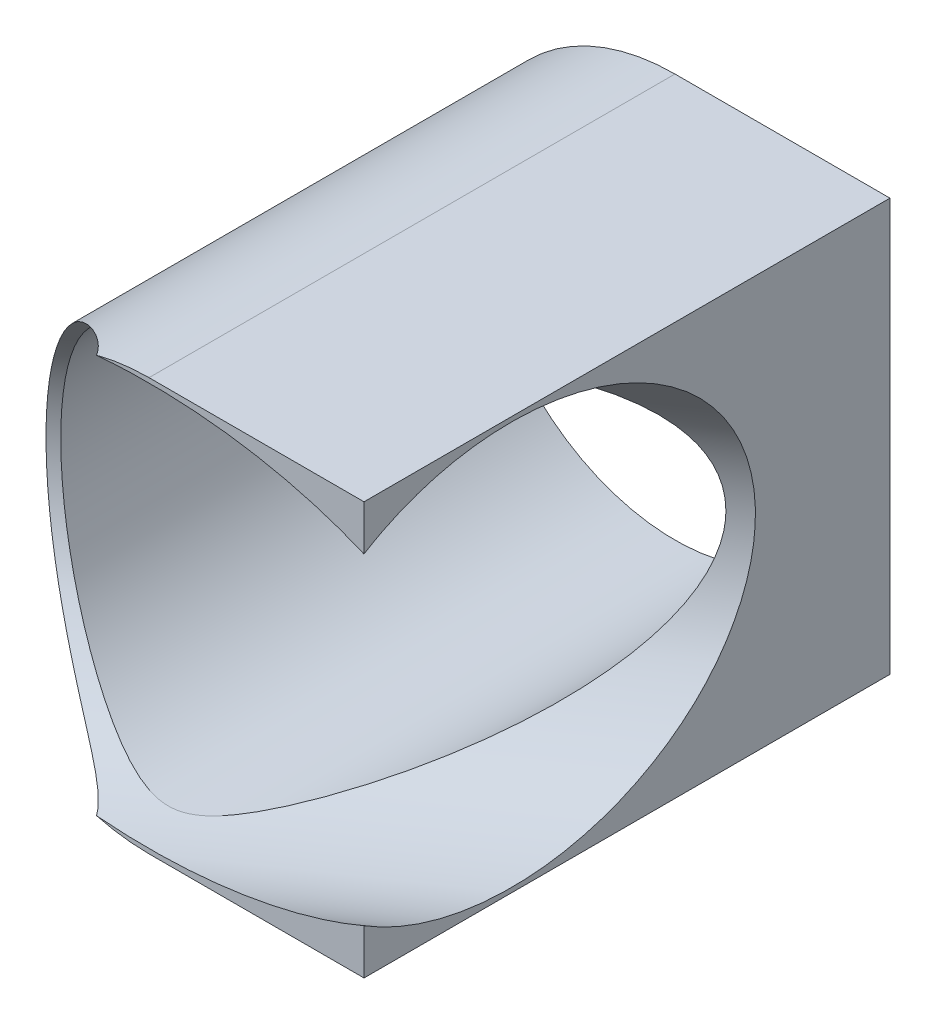
ISO-10303-21;
HEADER;
FILE_DESCRIPTION(('STEP AP214'),'2;1');
FILE_NAME('part.step','',(''),(''),'','','');
FILE_SCHEMA(('AUTOMOTIVE_DESIGN { 1 0 10303 214 1 1 1 1 }'));
ENDSEC;
DATA;
#1=APPLICATION_CONTEXT('core data for automotive mechanical design processes');
#2=APPLICATION_PROTOCOL_DEFINITION('international standard','automotive_design',2000,#1);
#3=PRODUCT_CONTEXT('',#1,'mechanical');
#4=PRODUCT('Part','Part','',(#3));
#5=PRODUCT_RELATED_PRODUCT_CATEGORY('part','',(#4));
#6=PRODUCT_DEFINITION_FORMATION('','',#4);
#7=PRODUCT_DEFINITION_CONTEXT('part definition',#1,'design');
#8=PRODUCT_DEFINITION('design','',#6,#7);
#9=PRODUCT_DEFINITION_SHAPE('','',#8);
#10=(LENGTH_UNIT() NAMED_UNIT(*) SI_UNIT(.MILLI.,.METRE.));
#11=(NAMED_UNIT(*) PLANE_ANGLE_UNIT() SI_UNIT($,.RADIAN.));
#12=(NAMED_UNIT(*) SI_UNIT($,.STERADIAN.) SOLID_ANGLE_UNIT());
#13=UNCERTAINTY_MEASURE_WITH_UNIT(LENGTH_MEASURE(1.E-05),#10,'distance_accuracy_value','');
#14=(GEOMETRIC_REPRESENTATION_CONTEXT(3) GLOBAL_UNCERTAINTY_ASSIGNED_CONTEXT((#13)) GLOBAL_UNIT_ASSIGNED_CONTEXT((#10,
#11,#12)) REPRESENTATION_CONTEXT('',''));
#15=CARTESIAN_POINT('',(0.,0.,0.));
#16=DIRECTION('',(0.,0.,1.));
#17=DIRECTION('',(1.,0.,0.));
#18=AXIS2_PLACEMENT_3D('',#15,#16,#17);
#19=CARTESIAN_POINT('',(443.127496956607,0.,0.));
#20=DIRECTION('',(0.,0.,1.));
#21=DIRECTION('',(1.,0.,0.));
#22=AXIS2_PLACEMENT_3D('',#19,#20,#21);
#23=PLANE('',#22);
#24=CARTESIAN_POINT('',(443.127496956607,0.,0.));
#25=DIRECTION('',(0.,0.,1.));
#26=DIRECTION('',(-1.,0.,0.));
#27=AXIS2_PLACEMENT_3D('',#24,#25,#26);
#28=ELLIPSE('',#27,40.7232190141487,22.9999999999998);
#29=CARTESIAN_POINT('',(437.138628317497,-22.7499247784139,0.));
#30=VERTEX_POINT('',#29);
#31=CARTESIAN_POINT('',(467.652496956607,-18.3613115773052,0.));
#32=VERTEX_POINT('',#31);
#33=EDGE_CURVE('E54',#30,#32,#28,.T.);
#34=ORIENTED_EDGE('',*,*,#33,.F.);
#35=CARTESIAN_POINT('',(443.127496956607,0.,0.));
#36=DIRECTION('',(0.,0.,1.));
#37=DIRECTION('',(1.,0.,0.));
#38=AXIS2_PLACEMENT_3D('',#35,#36,#37);
#39=CIRCLE('',#38,23.525);
#40=CARTESIAN_POINT('',(443.127496956607,-23.5250000000001,0.));
#41=VERTEX_POINT('',#40);
#42=EDGE_CURVE('E137',#30,#41,#39,.T.);
#43=ORIENTED_EDGE('',*,*,#42,.T.);
#44=DIRECTION('',(1.,0.,0.));
#45=VECTOR('',#44,1.);
#46=CARTESIAN_POINT('',(0.,-23.5250000000001,0.));
#47=LINE('',#46,#45);
#48=CARTESIAN_POINT('',(467.652496956607,-23.5250000000001,0.));
#49=VERTEX_POINT('',#48);
#50=EDGE_CURVE('E107',#41,#49,#47,.T.);
#51=ORIENTED_EDGE('',*,*,#50,.T.);
#52=DIRECTION('',(0.,-1.,0.));
#53=VECTOR('',#52,1.);
#54=CARTESIAN_POINT('',(467.652496956607,0.,0.));
#55=LINE('',#54,#53);
#56=EDGE_CURVE('E108',#32,#49,#55,.T.);
#57=ORIENTED_EDGE('',*,*,#56,.F.);
#58=EDGE_LOOP('',(#34,#43,#51,#57));
#59=FACE_BOUND('',#58,.T.);
#60=ADVANCED_FACE('F39',(#59),#23,.T.);
#61=CARTESIAN_POINT('',(443.127496956607,0.,-60.));
#62=DIRECTION('',(0.,0.,1.));
#63=DIRECTION('',(1.,0.,0.));
#64=AXIS2_PLACEMENT_3D('',#61,#62,#63);
#65=CYLINDRICAL_SURFACE('',#64,23.525);
#66=CARTESIAN_POINT('',(437.138628317499,22.7499247784142,0.));
#67=CARTESIAN_POINT('',(437.020110901523,22.7187530588571,-0.173055097348059));
#68=CARTESIAN_POINT('',(436.894581251069,22.684692408609,-0.340478476893277));
#69=CARTESIAN_POINT('',(436.632764521295,22.611107332507,-0.664943084657582));
#70=CARTESIAN_POINT('',(436.496497723802,22.5715931067808,-0.822002904178768));
#71=CARTESIAN_POINT('',(436.216823205073,22.4875412869307,-1.12637098787046));
#72=CARTESIAN_POINT('',(436.073461229149,22.4430339966222,-1.27373029451775));
#73=CARTESIAN_POINT('',(435.780907771819,22.3489798257649,-1.56097676056322));
#74=CARTESIAN_POINT('',(435.631713297798,22.2994303366321,-1.70085999455026));
#75=CARTESIAN_POINT('',(435.180065793828,22.1441763074845,-2.10902483067377));
#76=CARTESIAN_POINT('',(434.871569042112,22.0312814669205,-2.36788930239519));
#77=CARTESIAN_POINT('',(434.246448753037,21.7868261056014,-2.86732611160577));
#78=CARTESIAN_POINT('',(433.929810620065,21.6552298227556,-3.10786201396241));
#79=CARTESIAN_POINT('',(433.342436863511,21.3954453070992,-3.53876252336825));
#80=CARTESIAN_POINT('',(433.072072446693,21.2698032341009,-3.73118084416592));
#81=CARTESIAN_POINT('',(432.531483935184,21.0057290264668,-4.10728532428709));
#82=CARTESIAN_POINT('',(432.261259857982,20.8672955648186,-4.29097057461828));
#83=CARTESIAN_POINT('',(431.722634871182,20.5778566403941,-4.65069340109859));
#84=CARTESIAN_POINT('',(431.454233320311,20.4268558770655,-4.82673379884115));
#85=CARTESIAN_POINT('',(430.920367921483,20.1123763045732,-5.17201150866635));
#86=CARTESIAN_POINT('',(430.65490436631,19.9488962643888,-5.34124814707044));
#87=CARTESIAN_POINT('',(429.861870469953,19.4382378454768,-5.84121262610525));
#88=CARTESIAN_POINT('',(429.340274507418,19.07223821192,-6.16247220131472));
#89=CARTESIAN_POINT('',(428.320196851699,18.2915916230296,-6.78161358384141));
#90=CARTESIAN_POINT('',(427.82171565679,17.8769436196814,-7.07949488729801));
#91=CARTESIAN_POINT('',(426.845997804909,16.9934782053798,-7.65661858741216));
#92=CARTESIAN_POINT('',(426.369223622015,16.5239058042701,-7.93549032992469));
#93=CARTESIAN_POINT('',(425.451317650106,15.5380805863218,-8.46843593582276));
#94=CARTESIAN_POINT('',(425.010186411785,15.0218270485047,-8.72250941607929));
#95=CARTESIAN_POINT('',(424.169786333274,13.9461778308106,-9.20395894548088));
#96=CARTESIAN_POINT('',(423.770450202063,13.3868540963941,-9.43137798188372));
#97=CARTESIAN_POINT('',(423.018161749056,12.2277353955308,-9.85812778685418));
#98=CARTESIAN_POINT('',(422.665205420068,11.627943932261,-10.0574609821319));
#99=CARTESIAN_POINT('',(422.031930964754,10.4321789780982,-10.41408383431));
#100=CARTESIAN_POINT('',(421.74838817599,9.83847603919768,-10.5732607746431));
#101=CARTESIAN_POINT('',(421.230088549444,8.62352710513029,-10.8636531372702));
#102=CARTESIAN_POINT('',(420.995330228296,8.00228194812391,-10.9948694097542));
#103=CARTESIAN_POINT('',(420.57805902103,6.73734846489034,-11.2277749903953));
#104=CARTESIAN_POINT('',(420.39552722493,6.09366835676602,-11.3294749858865));
#105=CARTESIAN_POINT('',(420.085391142123,4.7891854932422,-11.5021150898799));
#106=CARTESIAN_POINT('',(419.95778134476,4.12838446274593,-11.5730582844041));
#107=CARTESIAN_POINT('',(419.769808185644,2.86504225936622,-11.6775094317535));
#108=CARTESIAN_POINT('',(419.703832643369,2.26358691024932,-11.7141426476938));
#109=CARTESIAN_POINT('',(419.618440646494,1.05638822571706,-11.7615508057553));
#110=CARTESIAN_POINT('',(419.599020455358,0.450645238342036,-11.7723278230975));
#111=CARTESIAN_POINT('',(419.606992134478,-0.760252161738513,-11.7679031943364));
#112=CARTESIAN_POINT('',(419.634370288931,-1.36540669490164,-11.7527091599082));
#113=CARTESIAN_POINT('',(419.735548636603,-2.57061202963635,-11.6965309096591));
#114=CARTESIAN_POINT('',(419.809348488547,-3.17066286869538,-11.655546883436));
#115=CARTESIAN_POINT('',(419.998285933192,-4.33573109079368,-11.5505369271638));
#116=CARTESIAN_POINT('',(420.111530158399,-4.90115247363401,-11.4875660952335));
#117=CARTESIAN_POINT('',(420.378351790723,-6.01933409588109,-11.3390342665208));
#118=CARTESIAN_POINT('',(420.531927591097,-6.57209483871329,-11.2534741696568));
#119=CARTESIAN_POINT('',(420.877703642275,-7.66152543666921,-11.0605549886845));
#120=CARTESIAN_POINT('',(421.069907186424,-8.19819391530407,-10.9531940458607));
#121=CARTESIAN_POINT('',(421.490873165466,-9.25225597172653,-10.7176097800469));
#122=CARTESIAN_POINT('',(421.719636857475,-9.76964888597239,-10.58938573968));
#123=CARTESIAN_POINT('',(422.220178850049,-10.800440927505,-10.308160925463));
#124=CARTESIAN_POINT('',(422.493200190718,-11.3130396349027,-10.1544396422485));
#125=CARTESIAN_POINT('',(423.07316046629,-12.3118968463829,-9.82687861582036));
#126=CARTESIAN_POINT('',(423.38010007308,-12.7981548283984,-9.65303847406984));
#127=CARTESIAN_POINT('',(424.024958828412,-13.7420985539968,-9.28636495911251));
#128=CARTESIAN_POINT('',(424.362875164007,-14.1997868856121,-9.09353331037634));
#129=CARTESIAN_POINT('',(424.890590635293,-14.8634054110998,-8.79086620018718));
#130=CARTESIAN_POINT('',(425.069978277324,-15.0808023451077,-8.68773535465331));
#131=CARTESIAN_POINT('',(425.435371718225,-15.507846852966,-8.47707332020348));
#132=CARTESIAN_POINT('',(425.621378834617,-15.7174928669731,-8.36954125463465));
#133=CARTESIAN_POINT('',(426.222998225285,-16.3717688428399,-8.02062741335845));
#134=CARTESIAN_POINT('',(426.650313305556,-16.8014772358958,-7.77116521830438));
#135=CARTESIAN_POINT('',(427.530216381684,-17.6213530460765,-7.25258365381495));
#136=CARTESIAN_POINT('',(427.982806562023,-18.01151703722,-6.9834625846768));
#137=CARTESIAN_POINT('',(428.677666743033,-18.5665364029316,-6.56481316511408));
#138=CARTESIAN_POINT('',(428.912243253091,-18.7467049980146,-6.42258727337538));
#139=CARTESIAN_POINT('',(429.385940531935,-19.0966466964921,-6.13313635764775));
#140=CARTESIAN_POINT('',(429.625060267078,-19.2664221282217,-5.98591246491301));
#141=CARTESIAN_POINT('',(430.107185759289,-19.5954659456789,-5.68629575259108));
#142=CARTESIAN_POINT('',(430.350190909707,-19.7547359521463,-5.53390373584245));
#143=CARTESIAN_POINT('',(430.83938470369,-20.062688694064,-5.22363646282902));
#144=CARTESIAN_POINT('',(431.085573387052,-20.2113712970081,-5.06576113797487));
#145=CARTESIAN_POINT('',(431.681480763917,-20.5566649910462,-4.6783190948616));
#146=CARTESIAN_POINT('',(432.032371960055,-20.7480156585583,-4.44583343563072));
#147=CARTESIAN_POINT('',(432.735951758324,-21.1091880696798,-3.96714928974385));
#148=CARTESIAN_POINT('',(433.088640599375,-21.2790068695774,-3.7209489347026));
#149=CARTESIAN_POINT('',(433.789462304832,-21.5956780313271,-3.21323037933639));
#150=CARTESIAN_POINT('',(434.13760987632,-21.742674410785,-2.95182385475028));
#151=CARTESIAN_POINT('',(434.653216862419,-21.9464460001439,-2.54319134575413));
#152=CARTESIAN_POINT('',(434.823965015934,-22.0115764454764,-2.40424293968935));
#153=CARTESIAN_POINT('',(435.162056227239,-22.1361644739702,-2.11983447118834));
#154=CARTESIAN_POINT('',(435.329399871248,-22.1956230403807,-1.97437554383123));
#155=CARTESIAN_POINT('',(435.644187972322,-22.303605912759,-1.68928301105889));
#156=CARTESIAN_POINT('',(435.792061418348,-22.352632809374,-1.55031612373177));
#157=CARTESIAN_POINT('',(436.082006371004,-22.4457093900971,-1.26502893190265));
#158=CARTESIAN_POINT('',(436.224081670219,-22.4897623620987,-1.11871357846026));
#159=CARTESIAN_POINT('',(436.501385273678,-22.5730205017855,-0.816429094963554));
#160=CARTESIAN_POINT('',(436.636561538248,-22.6121913440085,-0.660402040078337));
#161=CARTESIAN_POINT('',(436.896354815917,-22.6851733043636,-0.338113313226863));
#162=CARTESIAN_POINT('',(437.020949858632,-22.7189733917394,-0.171831526928433));
#163=CARTESIAN_POINT('',(437.138628317497,-22.7499247784139,0.));
#164=B_SPLINE_CURVE_WITH_KNOTS('',3,(#66,#67,#68,#69,#70,#71,#72,#73,#74,#75,#76,#77,#78,#79,
#80,#81,#82,#83,#84,#85,#86,#87,#88,#89,#90,#91,#92,#93,#94,#95,#96,#97,#98,#99,#100,#101,#102,
#103,#104,#105,#106,#107,#108,#109,#110,#111,#112,#113,#114,#115,#116,#117,#118,#119,#120,#121,
#122,#123,#124,#125,#126,#127,#128,#129,#130,#131,#132,#133,#134,#135,#136,#137,#138,#139,#140,
#141,#142,#143,#144,#145,#146,#147,#148,#149,#150,#151,#152,#153,#154,#155,#156,#157,#158,#159,
#160,#161,#162,#163),.UNSPECIFIED.,.F.,.F.,(4,2,2,2,2,2,2,2,2,2,2,2,2,2,2,2,2,2,2,2,2,2,2,2,2,2,
2,2,2,2,2,2,2,2,2,2,2,2,2,2,2,2,2,2,2,2,2,2,4),(0.,0.635584059088125,1.26999506550824,
1.90074512252243,2.53182317358743,3.78524688858343,5.04110056513301,6.10525025784077,
7.16951047245752,8.23337448786984,9.29734358430649,11.4355443123457,13.5737911113467,
15.745959041102,17.9181605251787,20.0868091032972,22.2552701879051,24.2832323554681,
26.3111328507063,28.33829815951,30.365260023048,32.1814786611115,33.9975515244238,
35.8130922188159,37.6286195662317,39.3668645116105,41.105040218681,42.8433641829271,
44.5817479320236,46.3821252595419,48.1825382570629,49.9827879235818,50.8829980371304,
51.7833883392087,53.7472486730096,55.711279003258,56.6956827024195,57.6798650567171,
58.6638952179861,59.6479376926796,61.0343386855092,62.420929015119,63.7983787920177,
64.4869519808138,65.1754055841694,65.8014680921804,66.4271143032924,67.0569371126849,
67.6880372181041),.UNSPECIFIED.);
#165=CARTESIAN_POINT('',(437.138628317499,22.7499247784142,0.));
#166=VERTEX_POINT('',#165);
#167=EDGE_CURVE('E152',#166,#30,#164,.T.);
#168=ORIENTED_EDGE('',*,*,#167,.F.);
#169=CARTESIAN_POINT('',(443.127496956608,23.5250000000005,0.));
#170=VERTEX_POINT('',#169);
#171=EDGE_CURVE('E102',#170,#166,#39,.T.);
#172=ORIENTED_EDGE('',*,*,#171,.F.);
#173=DIRECTION('',(0.,0.,-1.));
#174=VECTOR('',#173,1.);
#175=CARTESIAN_POINT('',(443.127496956607,23.525,0.));
#176=LINE('',#175,#174);
#177=CARTESIAN_POINT('',(443.127496956607,23.525,-60.));
#178=VERTEX_POINT('',#177);
#179=EDGE_CURVE('E111',#170,#178,#176,.T.);
#180=ORIENTED_EDGE('',*,*,#179,.T.);
#181=CARTESIAN_POINT('',(443.127496956607,0.,-60.));
#182=DIRECTION('',(0.,0.,1.));
#183=DIRECTION('',(1.,0.,0.));
#184=AXIS2_PLACEMENT_3D('',#181,#182,#183);
#185=CIRCLE('',#184,23.525);
#186=CARTESIAN_POINT('',(443.127496956607,-23.5250000000001,-60.));
#187=VERTEX_POINT('',#186);
#188=EDGE_CURVE('E48',#178,#187,#185,.T.);
#189=ORIENTED_EDGE('',*,*,#188,.T.);
#190=DIRECTION('',(0.,0.,-1.));
#191=VECTOR('',#190,1.);
#192=CARTESIAN_POINT('',(443.127496956607,-23.5250000000001,0.));
#193=LINE('',#192,#191);
#194=EDGE_CURVE('E126',#41,#187,#193,.T.);
#195=ORIENTED_EDGE('',*,*,#194,.F.);
#196=ORIENTED_EDGE('',*,*,#42,.F.);
#197=EDGE_LOOP('',(#168,#172,#180,#189,#195,#196));
#198=FACE_BOUND('',#197,.T.);
#199=ADVANCED_FACE('F41',(#198),#65,.T.);
#200=CARTESIAN_POINT('',(443.127496956607,0.,-60.));
#201=DIRECTION('',(0.,0.,1.));
#202=DIRECTION('',(1.,0.,0.));
#203=AXIS2_PLACEMENT_3D('',#200,#201,#202);
#204=PLANE('',#203);
#205=CARTESIAN_POINT('',(443.127496956607,0.,-60.));
#206=DIRECTION('',(0.,0.,1.));
#207=DIRECTION('',(1.,0.,0.));
#208=AXIS2_PLACEMENT_3D('',#205,#206,#207);
#209=CIRCLE('',#208,22.525);
#210=CARTESIAN_POINT('',(465.652496956607,0.,-60.));
#211=VERTEX_POINT('',#210);
#212=EDGE_CURVE('E129',#211,#211,#209,.T.);
#213=ORIENTED_EDGE('',*,*,#212,.T.);
#214=EDGE_LOOP('',(#213));
#215=FACE_BOUND('',#214,.T.);
#216=ORIENTED_EDGE('',*,*,#188,.F.);
#217=DIRECTION('',(1.,0.,0.));
#218=VECTOR('',#217,1.);
#219=CARTESIAN_POINT('',(5.71331176813235E-13,23.5250000000113,-60.));
#220=LINE('',#219,#218);
#221=CARTESIAN_POINT('',(467.652496956607,23.5249999999999,-60.));
#222=VERTEX_POINT('',#221);
#223=EDGE_CURVE('E116',#178,#222,#220,.T.);
#224=ORIENTED_EDGE('',*,*,#223,.T.);
#225=DIRECTION('',(0.,-1.,0.));
#226=VECTOR('',#225,1.);
#227=CARTESIAN_POINT('',(467.652496956607,0.,-60.));
#228=LINE('',#227,#226);
#229=CARTESIAN_POINT('',(467.652496956607,-23.5250000000001,-60.));
#230=VERTEX_POINT('',#229);
#231=EDGE_CURVE('E119',#222,#230,#228,.T.);
#232=ORIENTED_EDGE('',*,*,#231,.T.);
#233=DIRECTION('',(1.,0.,0.));
#234=VECTOR('',#233,1.);
#235=CARTESIAN_POINT('',(0.,-23.5250000000001,-60.));
#236=LINE('',#235,#234);
#237=EDGE_CURVE('E123',#187,#230,#236,.T.);
#238=ORIENTED_EDGE('',*,*,#237,.F.);
#239=EDGE_LOOP('',(#216,#224,#232,#238));
#240=FACE_BOUND('',#239,.T.);
#241=ADVANCED_FACE('F149',(#215,#240),#204,.F.);
#242=CARTESIAN_POINT('',(467.652496956607,18.3613115773053,0.));
#243=VERTEX_POINT('',#242);
#244=EDGE_CURVE('E94',#243,#166,#28,.T.);
#245=ORIENTED_EDGE('',*,*,#244,.F.);
#246=CARTESIAN_POINT('',(467.652496956607,23.5249999999999,0.));
#247=VERTEX_POINT('',#246);
#248=EDGE_CURVE('E100',#247,#243,#55,.T.);
#249=ORIENTED_EDGE('',*,*,#248,.F.);
#250=DIRECTION('',(1.,0.,0.));
#251=VECTOR('',#250,1.);
#252=CARTESIAN_POINT('',(5.71331176813235E-13,23.5250000000113,0.));
#253=LINE('',#252,#251);
#254=EDGE_CURVE('E62',#170,#247,#253,.T.);
#255=ORIENTED_EDGE('',*,*,#254,.F.);
#256=ORIENTED_EDGE('',*,*,#171,.T.);
#257=EDGE_LOOP('',(#245,#249,#255,#256));
#258=FACE_BOUND('',#257,.T.);
#259=ADVANCED_FACE('F99',(#258),#23,.T.);
#260=CARTESIAN_POINT('',(443.127496956607,0.,-60.));
#261=DIRECTION('',(0.,0.,1.));
#262=DIRECTION('',(1.,0.,0.));
#263=AXIS2_PLACEMENT_3D('',#260,#261,#262);
#264=CYLINDRICAL_SURFACE('',#263,22.525);
#265=CARTESIAN_POINT('',(465.652496956607,0.,-43.2868498389119));
#266=CARTESIAN_POINT('',(465.652494465942,0.321644779432443,-43.2868451594193));
#267=CARTESIAN_POINT('',(465.64558807089,0.6434022277661,-43.2739221497889));
#268=CARTESIAN_POINT('',(465.618138391833,1.28441893401865,-43.2225610441233));
#269=CARTESIAN_POINT('',(465.597586313255,1.60367644639243,-43.1841064931426));
#270=CARTESIAN_POINT('',(465.543318240228,2.23787616530317,-43.0825726760547));
#271=CARTESIAN_POINT('',(465.509571635113,2.55280656161178,-43.0194361490033));
#272=CARTESIAN_POINT('',(465.429739085236,3.17557292323857,-42.8700896561805));
#273=CARTESIAN_POINT('',(465.383650000485,3.48340706155833,-42.7838738189175));
#274=CARTESIAN_POINT('',(465.268087584876,4.16098639957606,-42.56772118876));
#275=CARTESIAN_POINT('',(465.195668676949,4.52847960423667,-42.4322795127983));
#276=CARTESIAN_POINT('',(465.035663885271,5.24823452374541,-42.1330788077021));
#277=CARTESIAN_POINT('',(464.948073597161,5.60049177827621,-41.9693115554755));
#278=CARTESIAN_POINT('',(464.665433619197,6.63344548613336,-41.440963242037));
#279=CARTESIAN_POINT('',(464.450558833413,7.29007949721306,-41.0394179904892));
#280=CARTESIAN_POINT('',(464.031882718738,8.40592063274723,-40.2574377097813));
#281=CARTESIAN_POINT('',(463.835259317635,8.87760269648919,-39.8903286935813));
#282=CARTESIAN_POINT('',(463.423117619241,9.78318722244702,-39.1212090830657));
#283=CARTESIAN_POINT('',(463.20758764568,10.2170660038477,-38.7191769225207));
#284=CARTESIAN_POINT('',(462.761369693257,11.0503647337624,-37.8873147151267));
#285=CARTESIAN_POINT('',(462.530654388322,11.4497193947044,-37.4574345789092));
#286=CARTESIAN_POINT('',(462.057303223395,12.2164250760138,-36.5760514119618));
#287=CARTESIAN_POINT('',(461.814662917495,12.5837640164614,-36.1245403183314));
#288=CARTESIAN_POINT('',(461.33097074376,13.273219217615,-35.2251705681191));
#289=CARTESIAN_POINT('',(461.090342940605,13.5966291369029,-34.7780695290966));
#290=CARTESIAN_POINT('',(460.601834393053,14.218987542213,-33.8711643054425));
#291=CARTESIAN_POINT('',(460.353954695373,14.5179395350031,-33.4113619546103));
#292=CARTESIAN_POINT('',(459.851808238868,15.0936761414807,-32.4808274565179));
#293=CARTESIAN_POINT('',(459.597535847723,15.3704402382268,-32.0100857007806));
#294=CARTESIAN_POINT('',(459.08368020248,15.9032326820397,-31.0598601718947));
#295=CARTESIAN_POINT('',(458.824096788194,16.1592604025137,-30.5803761351158));
#296=CARTESIAN_POINT('',(458.299825605283,16.6525020440499,-29.613276057588));
#297=CARTESIAN_POINT('',(458.035129607025,16.889681824062,-29.1256471128021));
#298=CARTESIAN_POINT('',(457.501585626977,17.3460202498331,-28.1442910671614));
#299=CARTESIAN_POINT('',(457.232737665564,17.5651789840071,-27.6505639962388));
#300=CARTESIAN_POINT('',(456.691375221232,17.9865067039026,-26.6582357505804));
#301=CARTESIAN_POINT('',(456.418862413089,18.1886831633785,-26.1596368289005));
#302=CARTESIAN_POINT('',(455.870308811836,18.5771176806561,-25.1582299393231));
#303=CARTESIAN_POINT('',(455.594268100474,18.76337610654,-24.6554220690471));
#304=CARTESIAN_POINT('',(454.972854498735,19.1632512886882,-23.52657391061));
#305=CARTESIAN_POINT('',(454.626577768773,19.3728672932646,-22.8996127078655));
#306=CARTESIAN_POINT('',(453.928849705274,19.770371752573,-21.6417422636879));
#307=CARTESIAN_POINT('',(453.57739851225,19.958260796083,-21.0108331297283));
#308=CARTESIAN_POINT('',(452.870610932534,20.312629769686,-19.7491962316525));
#309=CARTESIAN_POINT('',(452.515299501226,20.4792032265774,-19.1184807051408));
#310=CARTESIAN_POINT('',(451.798536674641,20.7928298727327,-17.8557472307254));
#311=CARTESIAN_POINT('',(451.437085705131,20.9398844094227,-17.2237293757857));
#312=CARTESIAN_POINT('',(450.795814660342,21.1815841991311,-16.1142210795677));
#313=CARTESIAN_POINT('',(450.517607175039,21.2802599933688,-15.6366719279614));
#314=CARTESIAN_POINT('',(449.955851722092,21.4671113120374,-14.6825252458363));
#315=CARTESIAN_POINT('',(449.672302711938,21.5552847616034,-14.2059279215885));
#316=CARTESIAN_POINT('',(449.095453525925,21.7221145348122,-13.2500546722076));
#317=CARTESIAN_POINT('',(448.80208265414,21.8006624833981,-12.7708023492953));
#318=CARTESIAN_POINT('',(448.206210936543,21.9471265595154,-11.8168552547783));
#319=CARTESIAN_POINT('',(447.90371699862,22.0150505017491,-11.3421573766229));
#320=CARTESIAN_POINT('',(447.280503663108,22.1411659032266,-10.3923443939721));
#321=CARTESIAN_POINT('',(446.959569557287,22.1991835008509,-9.917345072851));
#322=CARTESIAN_POINT('',(446.461928779527,22.2774623457538,-9.21417296426398));
#323=CARTESIAN_POINT('',(446.293049381316,22.3021308525458,-8.98095916999346));
#324=CARTESIAN_POINT('',(445.948573751664,22.3483201039886,-8.51924475800291));
#325=CARTESIAN_POINT('',(445.772978409653,22.369841263652,-8.2907435222993));
#326=CARTESIAN_POINT('',(445.416302348832,22.409119452753,-7.84416954421897));
#327=CARTESIAN_POINT('',(445.235369416804,22.4269352482319,-7.6259847039959));
#328=CARTESIAN_POINT('',(444.862686627474,22.4588461697756,-7.19844357109576));
#329=CARTESIAN_POINT('',(444.670930541747,22.4729391264012,-6.98909248562209));
#330=CARTESIAN_POINT('',(444.274820806045,22.4966319777404,-6.58464058340572));
#331=CARTESIAN_POINT('',(444.070547345218,22.5062576544531,-6.38946362196132));
#332=CARTESIAN_POINT('',(443.645168170935,22.520054570266,-6.01840032869636));
#333=CARTESIAN_POINT('',(443.424090916992,22.5242348232966,-5.84248256008905));
#334=CARTESIAN_POINT('',(443.068034662562,22.5252670294785,-5.59273108662356));
#335=CARTESIAN_POINT('',(442.939989793629,22.5245982694038,-5.50904058622775));
#336=CARTESIAN_POINT('',(442.678032847386,22.5208983718443,-5.35141464053133));
#337=CARTESIAN_POINT('',(442.544118981668,22.5178665094816,-5.27748219663795));
#338=CARTESIAN_POINT('',(442.134609391309,22.504747972641,-5.07334050412231));
#339=CARTESIAN_POINT('',(441.850224292882,22.4906466455119,-4.96004376826904));
#340=CARTESIAN_POINT('',(441.412613042897,22.460107986498,-4.82990070219728));
#341=CARTESIAN_POINT('',(441.264670099643,22.4483388917573,-4.79312786267068));
#342=CARTESIAN_POINT('',(440.966423742396,22.4215923341676,-4.7325370401676));
#343=CARTESIAN_POINT('',(440.81612019659,22.4066146915639,-4.7087197832758));
#344=CARTESIAN_POINT('',(440.362666860004,22.356735861121,-4.65552557343239));
#345=CARTESIAN_POINT('',(440.057820344867,22.3169463600133,-4.64464645710785));
#346=CARTESIAN_POINT('',(439.495696660232,22.2318417612838,-4.65976860965159));
#347=CARTESIAN_POINT('',(439.237931349929,22.1881644562422,-4.68065094259955));
#348=CARTESIAN_POINT('',(438.726352297765,22.0923800663313,-4.74304609555004));
#349=CARTESIAN_POINT('',(438.472542285945,22.0402654965715,-4.78457730202107));
#350=CARTESIAN_POINT('',(437.968918657841,21.9278715099595,-4.8828344278966));
#351=CARTESIAN_POINT('',(437.719121091485,21.8675655818515,-4.9396102947436));
#352=CARTESIAN_POINT('',(437.224404705655,21.7392365144892,-5.06409670000529));
#353=CARTESIAN_POINT('',(436.979484640522,21.6712153761144,-5.13180440525349));
#354=CARTESIAN_POINT('',(436.451346653384,21.5149555395229,-5.28782738317088));
#355=CARTESIAN_POINT('',(436.16901253964,21.4252685263008,-5.37766971221287));
#356=CARTESIAN_POINT('',(435.610297211257,21.2356863159142,-5.56490013936561));
#357=CARTESIAN_POINT('',(435.333917376559,21.1357887825681,-5.66228996311598));
#358=CARTESIAN_POINT('',(434.786682819251,20.9258783195414,-5.86227455320017));
#359=CARTESIAN_POINT('',(434.515832446321,20.8158577750165,-5.96487321134564));
#360=CARTESIAN_POINT('',(433.979707569206,20.5858849088284,-6.17348028013919));
#361=CARTESIAN_POINT('',(433.714433669391,20.4659315175449,-6.27948905725291));
#362=CARTESIAN_POINT('',(432.926835920682,20.0912983547947,-6.60062556496504));
#363=CARTESIAN_POINT('',(432.412715077731,19.8218375396916,-6.81887135199687));
#364=CARTESIAN_POINT('',(431.407340132291,19.244465401243,-7.25625703769211));
#365=CARTESIAN_POINT('',(430.916078220931,18.9365673428546,-7.47539660279003));
#366=CARTESIAN_POINT('',(429.914974629923,18.2538661391546,-7.92929255247973));
#367=CARTESIAN_POINT('',(429.407355947822,17.8755499003484,-8.16370801615018));
#368=CARTESIAN_POINT('',(428.669478430884,17.275470487625,-8.50852777362253));
#369=CARTESIAN_POINT('',(428.427420287208,17.0699866715883,-8.62234532075959));
#370=CARTESIAN_POINT('',(427.951442947663,16.6482475007372,-8.84729714637037));
#371=CARTESIAN_POINT('',(427.717526038747,16.4319891600795,-8.95843066823421));
#372=CARTESIAN_POINT('',(427.028908078491,15.7676173858959,-9.28698200970272));
#373=CARTESIAN_POINT('',(426.587054005193,15.3036751089294,-9.49968477291156));
#374=CARTESIAN_POINT('',(425.741452163713,14.3357568923438,-9.90918106383021));
#375=CARTESIAN_POINT('',(425.337701338582,13.8317841702727,-10.105975867622));
#376=CARTESIAN_POINT('',(424.75925965357,13.0419804514824,-10.3891556713566));
#377=CARTESIAN_POINT('',(424.569041554708,12.7698854957514,-10.4825040855989));
#378=CARTESIAN_POINT('',(424.200114442047,12.2163998563505,-10.6639130819136));
#379=CARTESIAN_POINT('',(424.02140268674,11.9350114113078,-10.7519749232278));
#380=CARTESIAN_POINT('',(423.503194672177,11.0773798595215,-11.0077582995605));
#381=CARTESIAN_POINT('',(423.181588527791,10.4876199387123,-11.1670959047726));
#382=CARTESIAN_POINT('',(422.590516906611,9.27695039209065,-11.4606309256995));
#383=CARTESIAN_POINT('',(422.321029073548,8.65605426679683,-11.5948391199429));
#384=CARTESIAN_POINT('',(421.837697101653,7.38784621263822,-11.8359469270924));
#385=CARTESIAN_POINT('',(421.623845399319,6.74053788825858,-11.9428502519467));
#386=CARTESIAN_POINT('',(421.275067086285,5.4970355802438,-12.1173966334219));
#387=CARTESIAN_POINT('',(421.134080361464,4.90295537909833,-12.1880479783829));
#388=CARTESIAN_POINT('',(420.900557044385,3.70300594879376,-12.305144704879));
#389=CARTESIAN_POINT('',(420.808016765459,3.09713762032515,-12.3515919282925));
#390=CARTESIAN_POINT('',(420.67262222433,1.878768453047,-12.4195672709726));
#391=CARTESIAN_POINT('',(420.629745348964,1.26627076110701,-12.441106731446));
#392=CARTESIAN_POINT('',(420.594175141047,0.0394575253433388,-12.4589747539457));
#393=CARTESIAN_POINT('',(420.601479939718,-0.574857949934026,-12.4553042547972));
#394=CARTESIAN_POINT('',(420.663892757479,-1.75716297569725,-12.4239553648772));
#395=CARTESIAN_POINT('',(420.715612866889,-2.32538039914152,-12.397978470462));
#396=CARTESIAN_POINT('',(420.861744419823,-3.45486920395963,-12.3246281265988));
#397=CARTESIAN_POINT('',(420.956153318015,-4.01614099741917,-12.2772559528511));
#398=CARTESIAN_POINT('',(421.186603272304,-5.1278744426859,-12.1617286296961));
#399=CARTESIAN_POINT('',(421.322644256935,-5.6783361130484,-12.0935735159654));
#400=CARTESIAN_POINT('',(421.63489280603,-6.76484395885493,-11.9373385030194));
#401=CARTESIAN_POINT('',(421.811101387025,-7.30088976908903,-11.8492580995499));
#402=CARTESIAN_POINT('',(422.203547093106,-8.35975328642357,-11.6534139251134));
#403=CARTESIAN_POINT('',(422.420112915399,-8.88241910941042,-11.5454886270881));
#404=CARTESIAN_POINT('',(422.890144892914,-9.90670235222304,-11.31175207167));
#405=CARTESIAN_POINT('',(423.14361098712,-10.4083198068517,-11.1859408438526));
#406=CARTESIAN_POINT('',(423.685121531334,-11.3878361026956,-10.9178883639297));
#407=CARTESIAN_POINT('',(423.973162091589,-11.8657376035081,-10.7756489601223));
#408=CARTESIAN_POINT('',(424.581459448943,-12.7956577942398,-10.4763008734792));
#409=CARTESIAN_POINT('',(424.901717308474,-13.2476756298215,-10.3191917002933));
#410=CARTESIAN_POINT('',(425.597009712586,-14.1565861175001,-9.97960370376216));
#411=CARTESIAN_POINT('',(425.974347130493,-14.6113373520798,-9.79610696988746));
#412=CARTESIAN_POINT('',(426.760543521513,-15.4869213578453,-9.41616339872608));
#413=CARTESIAN_POINT('',(427.169405087115,-15.9077513335743,-9.2197154965516));
#414=CARTESIAN_POINT('',(428.016589387065,-16.7146301675943,-8.81604146645569));
#415=CARTESIAN_POINT('',(428.454959801725,-17.1006202564685,-8.60879802352717));
#416=CARTESIAN_POINT('',(429.357972937365,-17.835774179421,-8.18676274690246));
#417=CARTESIAN_POINT('',(429.822612596383,-18.1849422919557,-7.9719717940493));
#418=CARTESIAN_POINT('',(430.82855618614,-18.8818986514334,-7.51439815114662));
#419=CARTESIAN_POINT('',(431.372676704268,-19.2253275422449,-7.27113106979947));
#420=CARTESIAN_POINT('',(432.209802253612,-19.7049011027848,-6.90725720661112));
#421=CARTESIAN_POINT('',(432.492486488863,-19.8589010723374,-6.78607465298112));
#422=CARTESIAN_POINT('',(433.064693907327,-20.1548842474647,-6.5452151764847));
#423=CARTESIAN_POINT('',(433.35421639296,-20.2968686720507,-6.42553810193447));
#424=CARTESIAN_POINT('',(433.939626960024,-20.5684866993775,-6.18929666391761));
#425=CARTESIAN_POINT('',(434.2355045742,-20.6981389488858,-6.07272779917185));
#426=CARTESIAN_POINT('',(434.834134977595,-20.9451809894266,-5.8444512287293));
#427=CARTESIAN_POINT('',(435.136886726873,-21.0625726204362,-5.73274279508945));
#428=CARTESIAN_POINT('',(435.749166624784,-21.2847787272441,-5.51701762300517));
#429=CARTESIAN_POINT('',(436.058685064794,-21.3896099823332,-5.41299069587542));
#430=CARTESIAN_POINT('',(436.685236385266,-21.5865859977525,-5.21638706824293));
#431=CARTESIAN_POINT('',(437.002265889004,-21.6787363367434,-5.12380533453953));
#432=CARTESIAN_POINT('',(437.537588520472,-21.8214963385913,-4.98394915332845));
#433=CARTESIAN_POINT('',(437.753648772161,-21.875728167945,-4.93184742744792));
#434=CARTESIAN_POINT('',(438.189480470673,-21.9782106178663,-4.83793849757291));
#435=CARTESIAN_POINT('',(438.409252492891,-22.0264603012361,-4.79613290562099));
#436=CARTESIAN_POINT('',(438.851503636341,-22.1165593927901,-4.72627921222339));
#437=CARTESIAN_POINT('',(439.073969993751,-22.1584314560047,-4.69818159338493));
#438=CARTESIAN_POINT('',(439.521478388002,-22.2356431735453,-4.65971228681277));
#439=CARTESIAN_POINT('',(439.746518780938,-22.270986774203,-4.64932985910701));
#440=CARTESIAN_POINT('',(440.273083458617,-22.3454672118708,-4.65149137940452));
#441=CARTESIAN_POINT('',(440.575093923286,-22.3819403291488,-4.67283266372819));
#442=CARTESIAN_POINT('',(441.172239482417,-22.4419762539951,-4.76608497088112));
#443=CARTESIAN_POINT('',(441.467388908219,-22.4655688311852,-4.83787850130962));
#444=CARTESIAN_POINT('',(442.040942032828,-22.5006222838509,-5.03351170916754));
#445=CARTESIAN_POINT('',(442.319326248264,-22.512069291763,-5.15741065469559));
#446=CARTESIAN_POINT('',(442.853309933154,-22.5249266557891,-5.44788462564927));
#447=CARTESIAN_POINT('',(443.108852383188,-22.5263125516267,-5.61456263742637));
#448=CARTESIAN_POINT('',(443.630138021752,-22.5210999367034,-6.00185299014893));
#449=CARTESIAN_POINT('',(443.892640914321,-22.5134039566729,-6.22670260803296));
#450=CARTESIAN_POINT('',(444.394960353573,-22.4907181569806,-6.70041368207879));
#451=CARTESIAN_POINT('',(444.634730985043,-22.4757139357494,-6.94932176814997));
#452=CARTESIAN_POINT('',(445.098994839171,-22.4397725539446,-7.46407867176286));
#453=CARTESIAN_POINT('',(445.323347937849,-22.4187881293773,-7.73004881283001));
#454=CARTESIAN_POINT('',(445.650147729024,-22.3835603138365,-8.13618767507063));
#455=CARTESIAN_POINT('',(445.757416729817,-22.371198436015,-8.27270626466988));
#456=CARTESIAN_POINT('',(445.969186308113,-22.3452861487769,-8.54776251044296));
#457=CARTESIAN_POINT('',(446.07368693549,-22.3317357607912,-8.68630013017275));
#458=CARTESIAN_POINT('',(446.403682282599,-22.2866477381437,-9.13141211936015));
#459=CARTESIAN_POINT('',(446.624661733629,-22.2529515155432,-9.44111516323233));
#460=CARTESIAN_POINT('',(447.05824435866,-22.1804663209663,-10.0657666104339));
#461=CARTESIAN_POINT('',(447.270846151747,-22.1416765139272,-10.3807158664399));
#462=CARTESIAN_POINT('',(447.689774244046,-22.0591670024039,-11.0143407375098));
#463=CARTESIAN_POINT('',(447.896097362436,-22.0154448502632,-11.3330181317181));
#464=CARTESIAN_POINT('',(448.303767553555,-21.9231718867574,-11.9728533527903));
#465=CARTESIAN_POINT('',(448.505114409147,-21.8746208651491,-12.2940112870919));
#466=CARTESIAN_POINT('',(449.104037521737,-21.7215786188718,-13.2612546247227));
#467=CARTESIAN_POINT('',(449.49569292534,-21.6098585091321,-13.9098743580422));
#468=CARTESIAN_POINT('',(450.268155725855,-21.3670346297016,-15.2096291976388));
#469=CARTESIAN_POINT('',(450.648966255668,-21.2359365271426,-15.8607635144837));
#470=CARTESIAN_POINT('',(451.402190910051,-20.9539168344416,-17.1628111691706));
#471=CARTESIAN_POINT('',(451.774612114724,-20.80301275459,-17.8137241988896));
#472=CARTESIAN_POINT('',(452.512937486589,-20.4805122337414,-19.1141990726208));
#473=CARTESIAN_POINT('',(452.878841109747,-20.3089140745741,-19.7637607998774));
#474=CARTESIAN_POINT('',(453.604466354831,-19.9442576155456,-21.0592829379207));
#475=CARTESIAN_POINT('',(453.964194576177,-19.7512241155292,-21.7052466209146));
#476=CARTESIAN_POINT('',(454.67820349042,-19.3423384654709,-22.9929274105267));
#477=CARTESIAN_POINT('',(455.032484480132,-19.126487563816,-23.634644747432));
#478=CARTESIAN_POINT('',(455.658270178743,-18.720634050463,-24.7719305354925));
#479=CARTESIAN_POINT('',(455.930846591446,-18.5353843175146,-25.2686077546456));
#480=CARTESIAN_POINT('',(456.472525044311,-18.1492833582113,-26.2577687759046));
#481=CARTESIAN_POINT('',(456.741627193991,-17.9484326250561,-26.7502527100286));
#482=CARTESIAN_POINT('',(457.276278053988,-17.5300573972429,-27.7304887736926));
#483=CARTESIAN_POINT('',(457.541824548353,-17.3125230257125,-28.2182379046898));
#484=CARTESIAN_POINT('',(458.068836335709,-16.8597949626416,-29.1877195394079));
#485=CARTESIAN_POINT('',(458.330301678956,-16.6246014887689,-29.6694521172039));
#486=CARTESIAN_POINT('',(458.847601813713,-16.1362923511465,-30.6237810969811));
#487=CARTESIAN_POINT('',(459.103455263097,-15.8832539390528,-31.0964068115236));
#488=CARTESIAN_POINT('',(459.610005436263,-15.3569514683465,-32.0331675071573));
#489=CARTESIAN_POINT('',(459.860701827677,-15.0836861113129,-32.4973019407815));
#490=CARTESIAN_POINT('',(460.355868588256,-14.5155338367555,-33.4149150954143));
#491=CARTESIAN_POINT('',(460.600344189272,-14.220665955771,-33.8684027440332));
#492=CARTESIAN_POINT('',(461.082170999608,-13.6072559261165,-34.7628936345211));
#493=CARTESIAN_POINT('',(461.319523749762,-13.2887189501961,-35.2038995752756));
#494=CARTESIAN_POINT('',(461.742406181845,-12.6873787773582,-35.9901771158818));
#495=CARTESIAN_POINT('',(461.929369472194,-12.4089356419435,-36.3380094512635));
#496=CARTESIAN_POINT('',(462.296689107385,-11.8336044088136,-37.0217309744749));
#497=CARTESIAN_POINT('',(462.477045790605,-11.5367172578715,-37.3576207739528));
#498=CARTESIAN_POINT('',(462.830227576101,-10.922623111158,-38.01567008222));
#499=CARTESIAN_POINT('',(463.003040401483,-10.6053849264725,-38.3378071923676));
#500=CARTESIAN_POINT('',(463.339312166614,-9.94957009858338,-38.964893222989));
#501=CARTESIAN_POINT('',(463.502771047485,-9.61099332109386,-39.2698420352721));
#502=CARTESIAN_POINT('',(463.820391658184,-8.90678286262768,-39.8625988670806));
#503=CARTESIAN_POINT('',(463.974412873442,-8.54086560082225,-40.1501472733625));
#504=CARTESIAN_POINT('',(464.2684932512,-7.78450508823807,-40.6993410467407));
#505=CARTESIAN_POINT('',(464.408549987745,-7.39405759512615,-40.9609819130404));
#506=CARTESIAN_POINT('',(464.671363581596,-6.58910218554305,-41.4520670340127));
#507=CARTESIAN_POINT('',(464.794160484882,-6.17465322369966,-41.6815858123368));
#508=CARTESIAN_POINT('',(465.019290221417,-5.32157843404271,-42.1024566972218));
#509=CARTESIAN_POINT('',(465.121637874777,-4.88297041118279,-42.293836443881));
#510=CARTESIAN_POINT('',(465.270826309915,-4.13985451547285,-42.5728440644977));
#511=CARTESIAN_POINT('',(465.3246098564,-3.84156627066973,-42.6734402161092));
#512=CARTESIAN_POINT('',(465.420809363093,-3.23689091492237,-42.8533844522144));
#513=CARTESIAN_POINT('',(465.463229009232,-2.93050646552781,-42.9327394263696));
#514=CARTESIAN_POINT('',(465.535684816954,-2.31202454053967,-43.068290666289));
#515=CARTESIAN_POINT('',(465.565751883297,-1.99994338821282,-43.1245447277711));
#516=CARTESIAN_POINT('',(465.612908126294,-1.37151395346266,-43.2127744593552));
#517=CARTESIAN_POINT('',(465.63000543762,-1.05516847258589,-43.2447653473935));
#518=CARTESIAN_POINT('',(465.644431918148,-0.615141317987262,-43.2717590381587));
#519=CARTESIAN_POINT('',(465.647454421437,-0.492212762920305,-43.2774145450653));
#520=CARTESIAN_POINT('',(465.651487520346,-0.24619498358006,-43.2849610337577));
#521=CARTESIAN_POINT('',(465.65249790988,-0.123105744140927,-43.2868516299325));
#522=CARTESIAN_POINT('',(465.652496956607,0.,-43.2868498389119));
#523=B_SPLINE_CURVE_WITH_KNOTS('',3,(#265,#266,#267,#268,#269,#270,#271,#272,#273,#274,#275,
#276,#277,#278,#279,#280,#281,#282,#283,#284,#285,#286,#287,#288,#289,#290,#291,#292,#293,#294,
#295,#296,#297,#298,#299,#300,#301,#302,#303,#304,#305,#306,#307,#308,#309,#310,#311,#312,#313,
#314,#315,#316,#317,#318,#319,#320,#321,#322,#323,#324,#325,#326,#327,#328,#329,#330,#331,#332,
#333,#334,#335,#336,#337,#338,#339,#340,#341,#342,#343,#344,#345,#346,#347,#348,#349,#350,#351,
#352,#353,#354,#355,#356,#357,#358,#359,#360,#361,#362,#363,#364,#365,#366,#367,#368,#369,#370,
#371,#372,#373,#374,#375,#376,#377,#378,#379,#380,#381,#382,#383,#384,#385,#386,#387,#388,#389,
#390,#391,#392,#393,#394,#395,#396,#397,#398,#399,#400,#401,#402,#403,#404,#405,#406,#407,#408,
#409,#410,#411,#412,#413,#414,#415,#416,#417,#418,#419,#420,#421,#422,#423,#424,#425,#426,#427,
#428,#429,#430,#431,#432,#433,#434,#435,#436,#437,#438,#439,#440,#441,#442,#443,#444,#445,#446,
#447,#448,#449,#450,#451,#452,#453,#454,#455,#456,#457,#458,#459,#460,#461,#462,#463,#464,#465,
#466,#467,#468,#469,#470,#471,#472,#473,#474,#475,#476,#477,#478,#479,#480,#481,#482,#483,#484,
#485,#486,#487,#488,#489,#490,#491,#492,#493,#494,#495,#496,#497,#498,#499,#500,#501,#502,#503,
#504,#505,#506,#507,#508,#509,#510,#511,#512,#513,#514,#515,#516,#517,#518,#519,#520,#521,#522),
.UNSPECIFIED.,.T.,.F.,(4,2,2,2,2,2,2,2,2,2,2,2,2,2,2,2,2,2,2,2,2,2,2,2,2,2,2,2,2,2,2,2,2,2,2,2,
2,2,2,2,2,2,2,2,2,2,2,2,2,2,2,2,2,2,2,2,2,2,2,2,2,2,2,2,2,2,2,2,2,2,2,2,2,2,2,2,2,2,2,2,2,2,2,2,
2,2,2,2,2,2,2,2,2,2,2,2,2,2,2,2,2,2,2,2,2,2,2,2,2,2,2,2,2,2,2,2,2,2,2,2,2,2,2,2,2,2,2,2,4),(0.,
0.964800447373881,1.93022330799291,2.8978993211188,3.86582175019411,5.05885711325574,
6.25223940506626,8.63977901758204,10.5251105540486,12.4116147380723,14.3016117680492,
16.1923188572091,17.9975531417501,19.8025281372434,21.609153373659,23.4158331806628,
25.2257143395147,27.0355866181901,28.8446581681025,30.6536878744426,32.8921316292903,
35.1305147104175,37.3587125684288,39.586756529874,41.2708949291273,42.9553655002951,
44.657333803761,46.358044242068,48.0860736220278,48.9529576974755,49.819727361407,
50.6714767425224,51.5237213807802,52.3709843489866,53.2168430343096,53.6753487117315,
54.133995090435,55.0475417895188,55.5057118016363,55.9639074888599,56.8829070676783,
57.6686513400251,58.4550965225664,59.2441505296643,60.0330003676715,60.9613041449889,
61.8898207970267,62.8190417093451,63.7483628154379,65.606933853806,67.4648652505243,
69.4877556452819,70.4994122279186,71.5113507379845,73.5340558569541,75.5565985601078,
76.5908775041717,77.6249091013231,79.6927769788731,81.7597558627452,83.8264536023641,
85.6680059100705,87.5094180593643,89.3499914312264,91.1904962600449,92.9019437019781,
94.6132891117873,96.3246315838587,98.0360173701426,99.7620047359046,101.487989247684,
103.213779761554,104.939627205482,106.793933634864,108.648392722056,110.505923707481,
112.363238622424,114.424445360203,115.45611614876,116.487682145585,117.517662714315,
118.547488488883,119.57592281617,120.603903252429,121.289959834441,121.976123762605,
122.659790358323,123.343042328399,124.254081763418,125.163006584724,126.072968084765,
126.985141117574,128.019837192133,129.056580531581,130.101756408532,130.623909925797,
131.146054029696,132.291647773251,133.437429565091,134.583782468709,135.730185305026,
138.027435088835,140.324014361872,142.618576756537,144.913329793498,147.205455021706,
149.497454907871,151.285469588135,153.073427766274,154.862452726798,156.651455639258,
158.433140127231,160.214939085594,161.995186351095,163.775045691282,165.224143014142,
166.673166012915,168.12446536461,169.575773850394,171.045089046218,172.514659053148,
173.980761022805,175.445796584683,176.402981225189,177.359855021754,178.314320031229,
179.268185901151,179.637414073123,180.006680060375),.UNSPECIFIED.);
#524=CARTESIAN_POINT('',(465.652496956607,0.,-43.2868498389119));
#525=VERTEX_POINT('',#524);
#526=EDGE_CURVE('E120',#525,#525,#523,.T.);
#527=ORIENTED_EDGE('',*,*,#526,.T.);
#528=EDGE_LOOP('',(#527));
#529=FACE_BOUND('',#528,.T.);
#530=ORIENTED_EDGE('',*,*,#212,.F.);
#531=EDGE_LOOP('',(#530));
#532=FACE_BOUND('',#531,.T.);
#533=ADVANCED_FACE('F170',(#529,#532),#264,.F.);
#534=CARTESIAN_POINT('',(0.,-23.5250000000001,0.));
#535=DIRECTION('',(0.,1.,0.));
#536=DIRECTION('',(0.,0.,1.));
#537=AXIS2_PLACEMENT_3D('',#534,#535,#536);
#538=PLANE('',#537);
#539=ORIENTED_EDGE('',*,*,#237,.T.);
#540=DIRECTION('',(0.,0.,-1.));
#541=VECTOR('',#540,1.);
#542=CARTESIAN_POINT('',(467.652496956607,-23.5250000000001,0.));
#543=LINE('',#542,#541);
#544=EDGE_CURVE('E130',#49,#230,#543,.T.);
#545=ORIENTED_EDGE('',*,*,#544,.F.);
#546=ORIENTED_EDGE('',*,*,#50,.F.);
#547=ORIENTED_EDGE('',*,*,#194,.T.);
#548=EDGE_LOOP('',(#539,#545,#546,#547));
#549=FACE_BOUND('',#548,.T.);
#550=ADVANCED_FACE('F146',(#549),#538,.F.);
#551=CARTESIAN_POINT('',(467.652496956607,0.,0.));
#552=DIRECTION('',(1.,0.,0.));
#553=DIRECTION('',(0.,0.,-1.));
#554=AXIS2_PLACEMENT_3D('',#551,#552,#553);
#555=PLANE('',#554);
#556=CARTESIAN_POINT('',(467.652496956607,0.,-16.7848203292783));
#557=DIRECTION('',(1.,0.,0.));
#558=DIRECTION('',(0.,0.,1.));
#559=AXIS2_PLACEMENT_3D('',#556,#557,#558);
#560=ELLIPSE('',#559,27.8708221970365,22.9999999999998);
#561=EDGE_CURVE('E11',#32,#243,#560,.T.);
#562=ORIENTED_EDGE('',*,*,#561,.F.);
#563=ORIENTED_EDGE('',*,*,#56,.T.);
#564=ORIENTED_EDGE('',*,*,#544,.T.);
#565=ORIENTED_EDGE('',*,*,#231,.F.);
#566=DIRECTION('',(0.,0.,-1.));
#567=VECTOR('',#566,1.);
#568=CARTESIAN_POINT('',(467.652496956607,23.5249999999999,0.));
#569=LINE('',#568,#567);
#570=EDGE_CURVE('E106',#247,#222,#569,.T.);
#571=ORIENTED_EDGE('',*,*,#570,.F.);
#572=ORIENTED_EDGE('',*,*,#248,.T.);
#573=EDGE_LOOP('',(#562,#563,#564,#565,#571,#572));
#574=FACE_BOUND('',#573,.T.);
#575=ADVANCED_FACE('F104',(#574),#555,.T.);
#576=CARTESIAN_POINT('',(5.71331176813235E-13,23.5250000000113,0.));
#577=DIRECTION('',(0.,1.,0.));
#578=DIRECTION('',(-1.,0.,0.));
#579=AXIS2_PLACEMENT_3D('',#576,#577,#578);
#580=PLANE('',#579);
#581=ORIENTED_EDGE('',*,*,#223,.F.);
#582=ORIENTED_EDGE('',*,*,#179,.F.);
#583=ORIENTED_EDGE('',*,*,#254,.T.);
#584=ORIENTED_EDGE('',*,*,#570,.T.);
#585=EDGE_LOOP('',(#581,#582,#583,#584));
#586=FACE_BOUND('',#585,.T.);
#587=ADVANCED_FACE('F151',(#586),#580,.T.);
#588=CARTESIAN_POINT('',(487.79438206078,0.,-30.5698528498287));
#589=DIRECTION('',(-0.825235790942879,0.,0.564788358012876));
#590=DIRECTION('',(0.564788358012876,0.,0.825235790942879));
#591=AXIS2_PLACEMENT_3D('',#588,#589,#590);
#592=CYLINDRICAL_SURFACE('',#591,22.9999999999998);
#593=ORIENTED_EDGE('',*,*,#167,.T.);
#594=ORIENTED_EDGE('',*,*,#33,.T.);
#595=ORIENTED_EDGE('',*,*,#561,.T.);
#596=ORIENTED_EDGE('',*,*,#244,.T.);
#597=EDGE_LOOP('',(#593,#594,#595,#596));
#598=FACE_BOUND('',#597,.T.);
#599=ORIENTED_EDGE('',*,*,#526,.F.);
#600=EDGE_LOOP('',(#599));
#601=FACE_BOUND('',#600,.T.);
#602=ADVANCED_FACE('F92',(#598,#601),#592,.F.);
#603=CLOSED_SHELL('',(#60,#199,#241,#259,#533,#550,#575,#587,#602));
#604=MANIFOLD_SOLID_BREP('B2',#603);
#605=ADVANCED_BREP_SHAPE_REPRESENTATION('',(#18,#604),#14);
#606=SHAPE_DEFINITION_REPRESENTATION(#9,#605);
ENDSEC;
END-ISO-10303-21;
